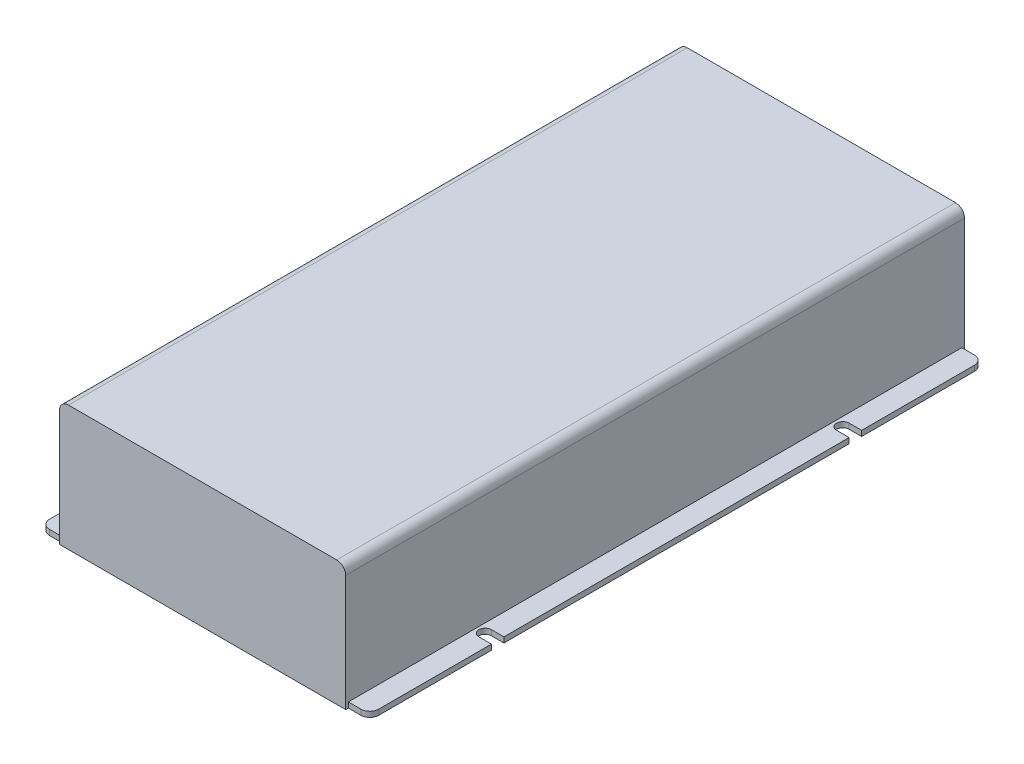
ISO-10303-21;
HEADER;
FILE_DESCRIPTION(('STEP AP214'),'2;1');
FILE_NAME('part.step','',(''),(''),'','','');
FILE_SCHEMA(('AUTOMOTIVE_DESIGN { 1 0 10303 214 1 1 1 1 }'));
ENDSEC;
DATA;
#1=APPLICATION_CONTEXT('core data for automotive mechanical design processes');
#2=APPLICATION_PROTOCOL_DEFINITION('international standard','automotive_design',2000,#1);
#3=PRODUCT_CONTEXT('',#1,'mechanical');
#4=PRODUCT('Part','Part','',(#3));
#5=PRODUCT_RELATED_PRODUCT_CATEGORY('part','',(#4));
#6=PRODUCT_DEFINITION_FORMATION('','',#4);
#7=PRODUCT_DEFINITION_CONTEXT('part definition',#1,'design');
#8=PRODUCT_DEFINITION('design','',#6,#7);
#9=PRODUCT_DEFINITION_SHAPE('','',#8);
#10=(LENGTH_UNIT() NAMED_UNIT(*) SI_UNIT(.MILLI.,.METRE.));
#11=(NAMED_UNIT(*) PLANE_ANGLE_UNIT() SI_UNIT($,.RADIAN.));
#12=(NAMED_UNIT(*) SI_UNIT($,.STERADIAN.) SOLID_ANGLE_UNIT());
#13=UNCERTAINTY_MEASURE_WITH_UNIT(LENGTH_MEASURE(1.E-05),#10,'distance_accuracy_value','');
#14=(GEOMETRIC_REPRESENTATION_CONTEXT(3) GLOBAL_UNCERTAINTY_ASSIGNED_CONTEXT((#13)) GLOBAL_UNIT_ASSIGNED_CONTEXT((#10,
#11,#12)) REPRESENTATION_CONTEXT('',''));
#15=CARTESIAN_POINT('',(0.,0.,0.));
#16=DIRECTION('',(0.,0.,1.));
#17=DIRECTION('',(1.,0.,0.));
#18=AXIS2_PLACEMENT_3D('',#15,#16,#17);
#19=CARTESIAN_POINT('',(92.,3.,171.5));
#20=DIRECTION('',(1.,0.,0.));
#21=DIRECTION('',(0.,0.,-1.));
#22=AXIS2_PLACEMENT_3D('',#19,#20,#21);
#23=PLANE('',#22);
#24=DIRECTION('',(0.,0.,1.));
#25=VECTOR('',#24,1.);
#26=CARTESIAN_POINT('',(92.,0.,171.5));
#27=LINE('',#26,#25);
#28=CARTESIAN_POINT('',(92.,0.,-166.5));
#29=VERTEX_POINT('',#28);
#30=CARTESIAN_POINT('',(92.,0.,-103.5));
#31=VERTEX_POINT('',#30);
#32=EDGE_CURVE('E541',#29,#31,#27,.T.);
#33=ORIENTED_EDGE('',*,*,#32,.F.);
#34=DIRECTION('',(0.,-1.,0.));
#35=VECTOR('',#34,1.);
#36=CARTESIAN_POINT('',(92.,3.,-166.5));
#37=LINE('',#36,#35);
#38=CARTESIAN_POINT('',(92.,3.,-166.5));
#39=VERTEX_POINT('',#38);
#40=EDGE_CURVE('E621',#29,#39,#37,.F.);
#41=ORIENTED_EDGE('',*,*,#40,.T.);
#42=DIRECTION('',(0.,0.,1.));
#43=VECTOR('',#42,1.);
#44=CARTESIAN_POINT('',(92.,3.,171.5));
#45=LINE('',#44,#43);
#46=CARTESIAN_POINT('',(92.,3.,-103.5));
#47=VERTEX_POINT('',#46);
#48=EDGE_CURVE('E529',#39,#47,#45,.T.);
#49=ORIENTED_EDGE('',*,*,#48,.T.);
#50=DIRECTION('',(0.,1.,0.));
#51=VECTOR('',#50,1.);
#52=CARTESIAN_POINT('',(92.,0.,-103.5));
#53=LINE('',#52,#51);
#54=EDGE_CURVE('E472',#31,#47,#53,.T.);
#55=ORIENTED_EDGE('',*,*,#54,.F.);
#56=EDGE_LOOP('',(#33,#41,#49,#55));
#57=FACE_BOUND('',#56,.T.);
#58=ADVANCED_FACE('F40',(#57),#23,.T.);
#59=CARTESIAN_POINT('',(92.,0.,-96.5));
#60=VERTEX_POINT('',#59);
#61=CARTESIAN_POINT('',(92.,0.,96.5));
#62=VERTEX_POINT('',#61);
#63=EDGE_CURVE('E544',#60,#62,#27,.T.);
#64=ORIENTED_EDGE('',*,*,#63,.F.);
#65=DIRECTION('',(0.,1.,0.));
#66=VECTOR('',#65,1.);
#67=CARTESIAN_POINT('',(92.,0.,-96.5));
#68=LINE('',#67,#66);
#69=CARTESIAN_POINT('',(92.,3.,-96.5));
#70=VERTEX_POINT('',#69);
#71=EDGE_CURVE('E476',#60,#70,#68,.T.);
#72=ORIENTED_EDGE('',*,*,#71,.T.);
#73=CARTESIAN_POINT('',(92.,3.,96.5));
#74=VERTEX_POINT('',#73);
#75=EDGE_CURVE('E533',#70,#74,#45,.T.);
#76=ORIENTED_EDGE('',*,*,#75,.T.);
#77=DIRECTION('',(0.,1.,0.));
#78=VECTOR('',#77,1.);
#79=CARTESIAN_POINT('',(92.,0.,96.5));
#80=LINE('',#79,#78);
#81=EDGE_CURVE('E509',#62,#74,#80,.T.);
#82=ORIENTED_EDGE('',*,*,#81,.F.);
#83=EDGE_LOOP('',(#64,#72,#76,#82));
#84=FACE_BOUND('',#83,.T.);
#85=ADVANCED_FACE('F734',(#84),#23,.T.);
#86=CARTESIAN_POINT('',(-80.,0.,173.));
#87=DIRECTION('',(0.,1.,0.));
#88=DIRECTION('',(0.,0.,1.));
#89=AXIS2_PLACEMENT_3D('',#86,#87,#88);
#90=PLANE('',#89);
#91=CARTESIAN_POINT('',(92.,0.,103.5));
#92=VERTEX_POINT('',#91);
#93=CARTESIAN_POINT('',(92.,0.,166.5));
#94=VERTEX_POINT('',#93);
#95=EDGE_CURVE('E540',#92,#94,#27,.T.);
#96=ORIENTED_EDGE('',*,*,#95,.T.);
#97=CARTESIAN_POINT('',(87.,0.,166.5));
#98=DIRECTION('',(0.,1.,0.));
#99=DIRECTION('',(0.,0.,1.));
#100=AXIS2_PLACEMENT_3D('',#97,#98,#99);
#101=CIRCLE('',#100,5.);
#102=CARTESIAN_POINT('',(87.,0.,171.5));
#103=VERTEX_POINT('',#102);
#104=EDGE_CURVE('E605',#94,#103,#101,.F.);
#105=ORIENTED_EDGE('',*,*,#104,.T.);
#106=DIRECTION('',(-1.,0.,0.));
#107=VECTOR('',#106,1.);
#108=CARTESIAN_POINT('',(80.,0.,171.5));
#109=LINE('',#108,#107);
#110=CARTESIAN_POINT('',(80.,0.,171.5));
#111=VERTEX_POINT('',#110);
#112=EDGE_CURVE('E525',#103,#111,#109,.T.);
#113=ORIENTED_EDGE('',*,*,#112,.T.);
#114=DIRECTION('',(0.,0.,-1.));
#115=VECTOR('',#114,1.);
#116=CARTESIAN_POINT('',(80.,0.,173.));
#117=LINE('',#116,#115);
#118=CARTESIAN_POINT('',(80.,0.,173.));
#119=VERTEX_POINT('',#118);
#120=EDGE_CURVE('E583',#119,#111,#117,.T.);
#121=ORIENTED_EDGE('',*,*,#120,.F.);
#122=DIRECTION('',(1.,0.,0.));
#123=VECTOR('',#122,1.);
#124=CARTESIAN_POINT('',(-80.,0.,173.));
#125=LINE('',#124,#123);
#126=CARTESIAN_POINT('',(-80.,0.,173.));
#127=VERTEX_POINT('',#126);
#128=EDGE_CURVE('E557',#127,#119,#125,.T.);
#129=ORIENTED_EDGE('',*,*,#128,.F.);
#130=DIRECTION('',(0.,0.,-1.));
#131=VECTOR('',#130,1.);
#132=CARTESIAN_POINT('',(-80.,0.,173.));
#133=LINE('',#132,#131);
#134=CARTESIAN_POINT('',(-80.,0.,171.5));
#135=VERTEX_POINT('',#134);
#136=EDGE_CURVE('E588',#127,#135,#133,.T.);
#137=ORIENTED_EDGE('',*,*,#136,.T.);
#138=DIRECTION('',(1.,0.,0.));
#139=VECTOR('',#138,1.);
#140=CARTESIAN_POINT('',(-80.,0.,171.5));
#141=LINE('',#140,#139);
#142=CARTESIAN_POINT('',(-87.,0.,171.5));
#143=VERTEX_POINT('',#142);
#144=EDGE_CURVE('E418',#143,#135,#141,.T.);
#145=ORIENTED_EDGE('',*,*,#144,.F.);
#146=CARTESIAN_POINT('',(-87.,0.,166.5));
#147=DIRECTION('',(0.,1.,0.));
#148=DIRECTION('',(0.,0.,1.));
#149=AXIS2_PLACEMENT_3D('',#146,#147,#148);
#150=CIRCLE('',#149,5.);
#151=CARTESIAN_POINT('',(-92.,0.,166.5));
#152=VERTEX_POINT('',#151);
#153=EDGE_CURVE('E599',#143,#152,#150,.F.);
#154=ORIENTED_EDGE('',*,*,#153,.T.);
#155=DIRECTION('',(0.,0.,1.));
#156=VECTOR('',#155,1.);
#157=CARTESIAN_POINT('',(-92.,0.,171.5));
#158=LINE('',#157,#156);
#159=CARTESIAN_POINT('',(-92.,0.,103.5));
#160=VERTEX_POINT('',#159);
#161=EDGE_CURVE('E432',#160,#152,#158,.T.);
#162=ORIENTED_EDGE('',*,*,#161,.F.);
#163=DIRECTION('',(-1.,0.,0.));
#164=VECTOR('',#163,1.);
#165=CARTESIAN_POINT('',(-85.,0.,103.5));
#166=LINE('',#165,#164);
#167=CARTESIAN_POINT('',(-85.,0.,103.5));
#168=VERTEX_POINT('',#167);
#169=EDGE_CURVE('E381',#168,#160,#166,.T.);
#170=ORIENTED_EDGE('',*,*,#169,.F.);
#171=CARTESIAN_POINT('',(-85.,0.,100.));
#172=DIRECTION('',(0.,-1.,0.));
#173=DIRECTION('',(0.,0.,-1.));
#174=AXIS2_PLACEMENT_3D('',#171,#172,#173);
#175=CIRCLE('',#174,3.5);
#176=CARTESIAN_POINT('',(-85.,0.,96.5));
#177=VERTEX_POINT('',#176);
#178=EDGE_CURVE('E377',#177,#168,#175,.T.);
#179=ORIENTED_EDGE('',*,*,#178,.F.);
#180=DIRECTION('',(1.,0.,0.));
#181=VECTOR('',#180,1.);
#182=CARTESIAN_POINT('',(-85.,0.,96.5));
#183=LINE('',#182,#181);
#184=CARTESIAN_POINT('',(-92.,0.,96.5));
#185=VERTEX_POINT('',#184);
#186=EDGE_CURVE('E386',#185,#177,#183,.T.);
#187=ORIENTED_EDGE('',*,*,#186,.F.);
#188=CARTESIAN_POINT('',(-92.,0.,-96.5));
#189=VERTEX_POINT('',#188);
#190=EDGE_CURVE('E354',#189,#185,#158,.T.);
#191=ORIENTED_EDGE('',*,*,#190,.F.);
#192=DIRECTION('',(1.,0.,0.));
#193=VECTOR('',#192,1.);
#194=CARTESIAN_POINT('',(-85.,0.,-96.5));
#195=LINE('',#194,#193);
#196=CARTESIAN_POINT('',(-85.,0.,-96.5));
#197=VERTEX_POINT('',#196);
#198=EDGE_CURVE('E330',#189,#197,#195,.T.);
#199=ORIENTED_EDGE('',*,*,#198,.T.);
#200=CARTESIAN_POINT('',(-85.,0.,-100.));
#201=DIRECTION('',(0.,1.,0.));
#202=DIRECTION('',(0.,0.,1.));
#203=AXIS2_PLACEMENT_3D('',#200,#201,#202);
#204=CIRCLE('',#203,3.5);
#205=CARTESIAN_POINT('',(-85.,0.,-103.5));
#206=VERTEX_POINT('',#205);
#207=EDGE_CURVE('E341',#197,#206,#204,.T.);
#208=ORIENTED_EDGE('',*,*,#207,.T.);
#209=DIRECTION('',(-1.,0.,0.));
#210=VECTOR('',#209,1.);
#211=CARTESIAN_POINT('',(-85.,0.,-103.5));
#212=LINE('',#211,#210);
#213=CARTESIAN_POINT('',(-92.,0.,-103.5));
#214=VERTEX_POINT('',#213);
#215=EDGE_CURVE('E338',#206,#214,#212,.T.);
#216=ORIENTED_EDGE('',*,*,#215,.T.);
#217=CARTESIAN_POINT('',(-92.,0.,-166.5));
#218=VERTEX_POINT('',#217);
#219=EDGE_CURVE('E433',#218,#214,#158,.T.);
#220=ORIENTED_EDGE('',*,*,#219,.F.);
#221=CARTESIAN_POINT('',(-87.,0.,-166.5));
#222=DIRECTION('',(0.,1.,0.));
#223=DIRECTION('',(0.,0.,1.));
#224=AXIS2_PLACEMENT_3D('',#221,#222,#223);
#225=CIRCLE('',#224,5.);
#226=CARTESIAN_POINT('',(-87.,0.,-171.5));
#227=VERTEX_POINT('',#226);
#228=EDGE_CURVE('E596',#218,#227,#225,.F.);
#229=ORIENTED_EDGE('',*,*,#228,.T.);
#230=DIRECTION('',(-1.,0.,0.));
#231=VECTOR('',#230,1.);
#232=CARTESIAN_POINT('',(-80.,0.,-171.5));
#233=LINE('',#232,#231);
#234=CARTESIAN_POINT('',(-80.,0.,-171.5));
#235=VERTEX_POINT('',#234);
#236=EDGE_CURVE('E404',#235,#227,#233,.T.);
#237=ORIENTED_EDGE('',*,*,#236,.F.);
#238=CARTESIAN_POINT('',(-80.,0.,-173.));
#239=VERTEX_POINT('',#238);
#240=EDGE_CURVE('E587',#235,#239,#133,.T.);
#241=ORIENTED_EDGE('',*,*,#240,.T.);
#242=DIRECTION('',(1.,0.,0.));
#243=VECTOR('',#242,1.);
#244=CARTESIAN_POINT('',(-80.,0.,-173.));
#245=LINE('',#244,#243);
#246=CARTESIAN_POINT('',(80.,0.,-173.));
#247=VERTEX_POINT('',#246);
#248=EDGE_CURVE('E572',#239,#247,#245,.T.);
#249=ORIENTED_EDGE('',*,*,#248,.T.);
#250=CARTESIAN_POINT('',(80.,0.,-171.5));
#251=VERTEX_POINT('',#250);
#252=EDGE_CURVE('E569',#251,#247,#117,.T.);
#253=ORIENTED_EDGE('',*,*,#252,.F.);
#254=DIRECTION('',(1.,0.,0.));
#255=VECTOR('',#254,1.);
#256=CARTESIAN_POINT('',(80.,0.,-171.5));
#257=LINE('',#256,#255);
#258=CARTESIAN_POINT('',(87.,0.,-171.5));
#259=VERTEX_POINT('',#258);
#260=EDGE_CURVE('E508',#251,#259,#257,.T.);
#261=ORIENTED_EDGE('',*,*,#260,.T.);
#262=CARTESIAN_POINT('',(87.,0.,-166.5));
#263=DIRECTION('',(0.,1.,0.));
#264=DIRECTION('',(0.,0.,1.));
#265=AXIS2_PLACEMENT_3D('',#262,#263,#264);
#266=CIRCLE('',#265,5.);
#267=EDGE_CURVE('E602',#259,#29,#266,.F.);
#268=ORIENTED_EDGE('',*,*,#267,.T.);
#269=ORIENTED_EDGE('',*,*,#32,.T.);
#270=DIRECTION('',(1.,0.,0.));
#271=VECTOR('',#270,1.);
#272=CARTESIAN_POINT('',(85.,0.,-103.5));
#273=LINE('',#272,#271);
#274=CARTESIAN_POINT('',(85.,0.,-103.5));
#275=VERTEX_POINT('',#274);
#276=EDGE_CURVE('E452',#275,#31,#273,.T.);
#277=ORIENTED_EDGE('',*,*,#276,.F.);
#278=CARTESIAN_POINT('',(85.,0.,-100.));
#279=DIRECTION('',(0.,-1.,0.));
#280=DIRECTION('',(0.,0.,1.));
#281=AXIS2_PLACEMENT_3D('',#278,#279,#280);
#282=CIRCLE('',#281,3.5);
#283=CARTESIAN_POINT('',(85.,0.,-96.5));
#284=VERTEX_POINT('',#283);
#285=EDGE_CURVE('E445',#284,#275,#282,.T.);
#286=ORIENTED_EDGE('',*,*,#285,.F.);
#287=DIRECTION('',(-1.,0.,0.));
#288=VECTOR('',#287,1.);
#289=CARTESIAN_POINT('',(85.,0.,-96.5));
#290=LINE('',#289,#288);
#291=EDGE_CURVE('E448',#60,#284,#290,.T.);
#292=ORIENTED_EDGE('',*,*,#291,.F.);
#293=ORIENTED_EDGE('',*,*,#63,.T.);
#294=DIRECTION('',(-1.,0.,0.));
#295=VECTOR('',#294,1.);
#296=CARTESIAN_POINT('',(85.,0.,96.5));
#297=LINE('',#296,#295);
#298=CARTESIAN_POINT('',(85.,0.,96.5));
#299=VERTEX_POINT('',#298);
#300=EDGE_CURVE('E492',#62,#299,#297,.T.);
#301=ORIENTED_EDGE('',*,*,#300,.T.);
#302=CARTESIAN_POINT('',(85.,0.,100.));
#303=DIRECTION('',(0.,1.,0.));
#304=DIRECTION('',(0.,0.,-1.));
#305=AXIS2_PLACEMENT_3D('',#302,#303,#304);
#306=CIRCLE('',#305,3.5);
#307=CARTESIAN_POINT('',(85.,0.,103.5));
#308=VERTEX_POINT('',#307);
#309=EDGE_CURVE('E483',#299,#308,#306,.T.);
#310=ORIENTED_EDGE('',*,*,#309,.T.);
#311=DIRECTION('',(1.,0.,0.));
#312=VECTOR('',#311,1.);
#313=CARTESIAN_POINT('',(85.,0.,103.5));
#314=LINE('',#313,#312);
#315=EDGE_CURVE('E487',#308,#92,#314,.T.);
#316=ORIENTED_EDGE('',*,*,#315,.T.);
#317=EDGE_LOOP('',(#96,#105,#113,#121,#129,#137,#145,#154,#162,#170,#179,#187,#191,#199,#208,
#216,#220,#229,#237,#241,#249,#253,#261,#268,#269,#277,#286,#292,#293,#301,#310,#316));
#318=FACE_BOUND('',#317,.T.);
#319=ADVANCED_FACE('F352',(#318),#90,.F.);
#320=CARTESIAN_POINT('',(0.,3.,0.));
#321=DIRECTION('',(0.,-1.,0.));
#322=DIRECTION('',(0.,0.,-1.));
#323=AXIS2_PLACEMENT_3D('',#320,#321,#322);
#324=PLANE('',#323);
#325=DIRECTION('',(-1.,0.,0.));
#326=VECTOR('',#325,1.);
#327=CARTESIAN_POINT('',(80.,3.,171.5));
#328=LINE('',#327,#326);
#329=CARTESIAN_POINT('',(87.,3.,171.5));
#330=VERTEX_POINT('',#329);
#331=CARTESIAN_POINT('',(80.,3.,171.5));
#332=VERTEX_POINT('',#331);
#333=EDGE_CURVE('E532',#330,#332,#328,.T.);
#334=ORIENTED_EDGE('',*,*,#333,.F.);
#335=CARTESIAN_POINT('',(87.,3.,166.5));
#336=DIRECTION('',(0.,-1.,0.));
#337=DIRECTION('',(0.,0.,-1.));
#338=AXIS2_PLACEMENT_3D('',#335,#336,#337);
#339=CIRCLE('',#338,5.);
#340=CARTESIAN_POINT('',(92.,3.,166.5));
#341=VERTEX_POINT('',#340);
#342=EDGE_CURVE('E614',#330,#341,#339,.F.);
#343=ORIENTED_EDGE('',*,*,#342,.T.);
#344=CARTESIAN_POINT('',(92.,3.,103.5));
#345=VERTEX_POINT('',#344);
#346=EDGE_CURVE('E528',#345,#341,#45,.T.);
#347=ORIENTED_EDGE('',*,*,#346,.F.);
#348=DIRECTION('',(1.,0.,0.));
#349=VECTOR('',#348,1.);
#350=CARTESIAN_POINT('',(85.,3.,103.5));
#351=LINE('',#350,#349);
#352=CARTESIAN_POINT('',(85.,3.,103.5));
#353=VERTEX_POINT('',#352);
#354=EDGE_CURVE('E499',#353,#345,#351,.T.);
#355=ORIENTED_EDGE('',*,*,#354,.F.);
#356=CARTESIAN_POINT('',(85.,3.,100.));
#357=DIRECTION('',(0.,1.,0.));
#358=DIRECTION('',(0.,0.,-1.));
#359=AXIS2_PLACEMENT_3D('',#356,#357,#358);
#360=CIRCLE('',#359,3.5);
#361=CARTESIAN_POINT('',(85.,3.,96.5));
#362=VERTEX_POINT('',#361);
#363=EDGE_CURVE('E471',#362,#353,#360,.T.);
#364=ORIENTED_EDGE('',*,*,#363,.F.);
#365=DIRECTION('',(-1.,0.,0.));
#366=VECTOR('',#365,1.);
#367=CARTESIAN_POINT('',(85.,3.,96.5));
#368=LINE('',#367,#366);
#369=EDGE_CURVE('E488',#74,#362,#368,.T.);
#370=ORIENTED_EDGE('',*,*,#369,.F.);
#371=ORIENTED_EDGE('',*,*,#75,.F.);
#372=DIRECTION('',(-1.,0.,0.));
#373=VECTOR('',#372,1.);
#374=CARTESIAN_POINT('',(85.,3.,-96.5));
#375=LINE('',#374,#373);
#376=CARTESIAN_POINT('',(85.,3.,-96.5));
#377=VERTEX_POINT('',#376);
#378=EDGE_CURVE('E460',#70,#377,#375,.T.);
#379=ORIENTED_EDGE('',*,*,#378,.T.);
#380=CARTESIAN_POINT('',(85.,3.,-100.));
#381=DIRECTION('',(0.,-1.,0.));
#382=DIRECTION('',(0.,0.,1.));
#383=AXIS2_PLACEMENT_3D('',#380,#381,#382);
#384=CIRCLE('',#383,3.5);
#385=CARTESIAN_POINT('',(85.,3.,-103.5));
#386=VERTEX_POINT('',#385);
#387=EDGE_CURVE('E442',#377,#386,#384,.T.);
#388=ORIENTED_EDGE('',*,*,#387,.T.);
#389=DIRECTION('',(1.,0.,0.));
#390=VECTOR('',#389,1.);
#391=CARTESIAN_POINT('',(85.,3.,-103.5));
#392=LINE('',#391,#390);
#393=EDGE_CURVE('E449',#386,#47,#392,.T.);
#394=ORIENTED_EDGE('',*,*,#393,.T.);
#395=ORIENTED_EDGE('',*,*,#48,.F.);
#396=CARTESIAN_POINT('',(87.,3.,-166.5));
#397=DIRECTION('',(0.,-1.,0.));
#398=DIRECTION('',(0.,0.,-1.));
#399=AXIS2_PLACEMENT_3D('',#396,#397,#398);
#400=CIRCLE('',#399,5.);
#401=CARTESIAN_POINT('',(87.,3.,-171.5));
#402=VERTEX_POINT('',#401);
#403=EDGE_CURVE('E611',#39,#402,#400,.F.);
#404=ORIENTED_EDGE('',*,*,#403,.T.);
#405=DIRECTION('',(1.,0.,0.));
#406=VECTOR('',#405,1.);
#407=CARTESIAN_POINT('',(80.,3.,-171.5));
#408=LINE('',#407,#406);
#409=CARTESIAN_POINT('',(80.,3.,-171.5));
#410=VERTEX_POINT('',#409);
#411=EDGE_CURVE('E524',#410,#402,#408,.T.);
#412=ORIENTED_EDGE('',*,*,#411,.F.);
#413=DIRECTION('',(0.,0.,-1.));
#414=VECTOR('',#413,1.);
#415=CARTESIAN_POINT('',(80.,3.,171.5));
#416=LINE('',#415,#414);
#417=EDGE_CURVE('E520',#332,#410,#416,.T.);
#418=ORIENTED_EDGE('',*,*,#417,.F.);
#419=EDGE_LOOP('',(#334,#343,#347,#355,#364,#370,#371,#379,#388,#394,#395,#404,#412,#418));
#420=FACE_BOUND('',#419,.T.);
#421=ADVANCED_FACE('F810',(#420),#324,.F.);
#422=CARTESIAN_POINT('',(80.,0.,173.));
#423=DIRECTION('',(-1.,0.,0.));
#424=DIRECTION('',(0.,0.,1.));
#425=AXIS2_PLACEMENT_3D('',#422,#423,#424);
#426=PLANE('',#425);
#427=DIRECTION('',(0.,1.,0.));
#428=VECTOR('',#427,1.);
#429=CARTESIAN_POINT('',(80.,0.,-173.));
#430=LINE('',#429,#428);
#431=CARTESIAN_POINT('',(80.,65.,-173.));
#432=VERTEX_POINT('',#431);
#433=EDGE_CURVE('E576',#247,#432,#430,.T.);
#434=ORIENTED_EDGE('',*,*,#433,.T.);
#435=DIRECTION('',(0.,0.,-1.));
#436=VECTOR('',#435,1.);
#437=CARTESIAN_POINT('',(80.,65.,173.));
#438=LINE('',#437,#436);
#439=CARTESIAN_POINT('',(80.,65.,173.));
#440=VERTEX_POINT('',#439);
#441=EDGE_CURVE('E637',#432,#440,#438,.F.);
#442=ORIENTED_EDGE('',*,*,#441,.T.);
#443=DIRECTION('',(0.,1.,0.));
#444=VECTOR('',#443,1.);
#445=CARTESIAN_POINT('',(80.,0.,173.));
#446=LINE('',#445,#444);
#447=EDGE_CURVE('E561',#119,#440,#446,.T.);
#448=ORIENTED_EDGE('',*,*,#447,.F.);
#449=ORIENTED_EDGE('',*,*,#120,.T.);
#450=DIRECTION('',(0.,-1.,0.));
#451=VECTOR('',#450,1.);
#452=CARTESIAN_POINT('',(80.,3.,171.5));
#453=LINE('',#452,#451);
#454=EDGE_CURVE('E547',#332,#111,#453,.T.);
#455=ORIENTED_EDGE('',*,*,#454,.F.);
#456=ORIENTED_EDGE('',*,*,#417,.T.);
#457=DIRECTION('',(0.,-1.,0.));
#458=VECTOR('',#457,1.);
#459=CARTESIAN_POINT('',(80.,3.,-171.5));
#460=LINE('',#459,#458);
#461=EDGE_CURVE('E536',#410,#251,#460,.T.);
#462=ORIENTED_EDGE('',*,*,#461,.T.);
#463=ORIENTED_EDGE('',*,*,#252,.T.);
#464=EDGE_LOOP('',(#434,#442,#448,#449,#455,#456,#462,#463));
#465=FACE_BOUND('',#464,.T.);
#466=ADVANCED_FACE('F774',(#465),#426,.F.);
#467=CARTESIAN_POINT('',(-80.,0.,173.));
#468=DIRECTION('',(1.,0.,0.));
#469=DIRECTION('',(0.,0.,-1.));
#470=AXIS2_PLACEMENT_3D('',#467,#468,#469);
#471=PLANE('',#470);
#472=DIRECTION('',(0.,-1.,0.));
#473=VECTOR('',#472,1.);
#474=CARTESIAN_POINT('',(-80.,0.,173.));
#475=LINE('',#474,#473);
#476=CARTESIAN_POINT('',(-80.,65.,173.));
#477=VERTEX_POINT('',#476);
#478=EDGE_CURVE('E554',#477,#127,#475,.T.);
#479=ORIENTED_EDGE('',*,*,#478,.F.);
#480=DIRECTION('',(0.,0.,-1.));
#481=VECTOR('',#480,1.);
#482=CARTESIAN_POINT('',(-80.,65.,173.));
#483=LINE('',#482,#481);
#484=CARTESIAN_POINT('',(-80.,65.,-173.));
#485=VERTEX_POINT('',#484);
#486=EDGE_CURVE('E646',#477,#485,#483,.T.);
#487=ORIENTED_EDGE('',*,*,#486,.T.);
#488=DIRECTION('',(0.,-1.,0.));
#489=VECTOR('',#488,1.);
#490=CARTESIAN_POINT('',(-80.,0.,-173.));
#491=LINE('',#490,#489);
#492=EDGE_CURVE('E551',#485,#239,#491,.T.);
#493=ORIENTED_EDGE('',*,*,#492,.T.);
#494=ORIENTED_EDGE('',*,*,#240,.F.);
#495=DIRECTION('',(0.,-1.,0.));
#496=VECTOR('',#495,1.);
#497=CARTESIAN_POINT('',(-80.,3.,-171.5));
#498=LINE('',#497,#496);
#499=CARTESIAN_POINT('',(-80.,3.,-171.5));
#500=VERTEX_POINT('',#499);
#501=EDGE_CURVE('E429',#500,#235,#498,.T.);
#502=ORIENTED_EDGE('',*,*,#501,.F.);
#503=DIRECTION('',(0.,0.,-1.));
#504=VECTOR('',#503,1.);
#505=CARTESIAN_POINT('',(-80.,3.,171.5));
#506=LINE('',#505,#504);
#507=CARTESIAN_POINT('',(-80.,3.,171.5));
#508=VERTEX_POINT('',#507);
#509=EDGE_CURVE('E414',#508,#500,#506,.T.);
#510=ORIENTED_EDGE('',*,*,#509,.F.);
#511=DIRECTION('',(0.,-1.,0.));
#512=VECTOR('',#511,1.);
#513=CARTESIAN_POINT('',(-80.,3.,171.5));
#514=LINE('',#513,#512);
#515=EDGE_CURVE('E438',#508,#135,#514,.T.);
#516=ORIENTED_EDGE('',*,*,#515,.T.);
#517=ORIENTED_EDGE('',*,*,#136,.F.);
#518=EDGE_LOOP('',(#479,#487,#493,#494,#502,#510,#516,#517));
#519=FACE_BOUND('',#518,.T.);
#520=ADVANCED_FACE('F702',(#519),#471,.F.);
#521=CARTESIAN_POINT('',(-80.,70.,173.));
#522=DIRECTION('',(0.,-1.,0.));
#523=DIRECTION('',(0.,0.,-1.));
#524=AXIS2_PLACEMENT_3D('',#521,#522,#523);
#525=PLANE('',#524);
#526=DIRECTION('',(-1.,0.,0.));
#527=VECTOR('',#526,1.);
#528=CARTESIAN_POINT('',(-80.,70.,173.));
#529=LINE('',#528,#527);
#530=CARTESIAN_POINT('',(75.,70.,173.));
#531=VERTEX_POINT('',#530);
#532=CARTESIAN_POINT('',(-75.,70.,173.));
#533=VERTEX_POINT('',#532);
#534=EDGE_CURVE('E565',#531,#533,#529,.T.);
#535=ORIENTED_EDGE('',*,*,#534,.F.);
#536=DIRECTION('',(0.,0.,-1.));
#537=VECTOR('',#536,1.);
#538=CARTESIAN_POINT('',(75.,70.,173.));
#539=LINE('',#538,#537);
#540=CARTESIAN_POINT('',(75.,70.,-173.));
#541=VERTEX_POINT('',#540);
#542=EDGE_CURVE('E627',#531,#541,#539,.T.);
#543=ORIENTED_EDGE('',*,*,#542,.T.);
#544=DIRECTION('',(-1.,0.,0.));
#545=VECTOR('',#544,1.);
#546=CARTESIAN_POINT('',(-80.,70.,-173.));
#547=LINE('',#546,#545);
#548=CARTESIAN_POINT('',(-75.,70.,-173.));
#549=VERTEX_POINT('',#548);
#550=EDGE_CURVE('E558',#541,#549,#547,.T.);
#551=ORIENTED_EDGE('',*,*,#550,.T.);
#552=DIRECTION('',(0.,0.,-1.));
#553=VECTOR('',#552,1.);
#554=CARTESIAN_POINT('',(-75.,70.,173.));
#555=LINE('',#554,#553);
#556=EDGE_CURVE('E624',#549,#533,#555,.F.);
#557=ORIENTED_EDGE('',*,*,#556,.T.);
#558=EDGE_LOOP('',(#535,#543,#551,#557));
#559=FACE_BOUND('',#558,.T.);
#560=ADVANCED_FACE('F785',(#559),#525,.F.);
#561=CARTESIAN_POINT('',(0.,0.,173.));
#562=DIRECTION('',(0.,0.,-1.));
#563=DIRECTION('',(-1.,0.,0.));
#564=AXIS2_PLACEMENT_3D('',#561,#562,#563);
#565=PLANE('',#564);
#566=ORIENTED_EDGE('',*,*,#447,.T.);
#567=CARTESIAN_POINT('',(75.,65.,173.));
#568=DIRECTION('',(0.,0.,-1.));
#569=DIRECTION('',(-1.,0.,0.));
#570=AXIS2_PLACEMENT_3D('',#567,#568,#569);
#571=CIRCLE('',#570,5.);
#572=EDGE_CURVE('E643',#440,#531,#571,.F.);
#573=ORIENTED_EDGE('',*,*,#572,.T.);
#574=ORIENTED_EDGE('',*,*,#534,.T.);
#575=CARTESIAN_POINT('',(-75.,65.,173.));
#576=DIRECTION('',(0.,0.,-1.));
#577=DIRECTION('',(-1.,0.,0.));
#578=AXIS2_PLACEMENT_3D('',#575,#576,#577);
#579=CIRCLE('',#578,5.);
#580=EDGE_CURVE('E640',#533,#477,#579,.F.);
#581=ORIENTED_EDGE('',*,*,#580,.T.);
#582=ORIENTED_EDGE('',*,*,#478,.T.);
#583=ORIENTED_EDGE('',*,*,#128,.T.);
#584=EDGE_LOOP('',(#566,#573,#574,#581,#582,#583));
#585=FACE_BOUND('',#584,.T.);
#586=ADVANCED_FACE('F778',(#585),#565,.F.);
#587=CARTESIAN_POINT('',(0.,0.,-173.));
#588=DIRECTION('',(0.,0.,-1.));
#589=DIRECTION('',(-1.,0.,0.));
#590=AXIS2_PLACEMENT_3D('',#587,#588,#589);
#591=PLANE('',#590);
#592=ORIENTED_EDGE('',*,*,#550,.F.);
#593=CARTESIAN_POINT('',(75.,65.,-173.));
#594=DIRECTION('',(0.,0.,-1.));
#595=DIRECTION('',(-1.,0.,0.));
#596=AXIS2_PLACEMENT_3D('',#593,#594,#595);
#597=CIRCLE('',#596,5.);
#598=EDGE_CURVE('E634',#541,#432,#597,.T.);
#599=ORIENTED_EDGE('',*,*,#598,.T.);
#600=ORIENTED_EDGE('',*,*,#433,.F.);
#601=ORIENTED_EDGE('',*,*,#248,.F.);
#602=ORIENTED_EDGE('',*,*,#492,.F.);
#603=CARTESIAN_POINT('',(-75.,65.,-173.));
#604=DIRECTION('',(0.,0.,-1.));
#605=DIRECTION('',(-1.,0.,0.));
#606=AXIS2_PLACEMENT_3D('',#603,#604,#605);
#607=CIRCLE('',#606,5.);
#608=EDGE_CURVE('E631',#485,#549,#607,.T.);
#609=ORIENTED_EDGE('',*,*,#608,.T.);
#610=EDGE_LOOP('',(#592,#599,#600,#601,#602,#609));
#611=FACE_BOUND('',#610,.T.);
#612=ADVANCED_FACE('F755',(#611),#591,.T.);
#613=CARTESIAN_POINT('',(80.,3.,171.5));
#614=DIRECTION('',(0.,0.,1.));
#615=DIRECTION('',(1.,0.,0.));
#616=AXIS2_PLACEMENT_3D('',#613,#614,#615);
#617=PLANE('',#616);
#618=ORIENTED_EDGE('',*,*,#112,.F.);
#619=DIRECTION('',(0.,-1.,0.));
#620=VECTOR('',#619,1.);
#621=CARTESIAN_POINT('',(87.,3.,171.5));
#622=LINE('',#621,#620);
#623=EDGE_CURVE('E608',#103,#330,#622,.F.);
#624=ORIENTED_EDGE('',*,*,#623,.T.);
#625=ORIENTED_EDGE('',*,*,#333,.T.);
#626=ORIENTED_EDGE('',*,*,#454,.T.);
#627=EDGE_LOOP('',(#618,#624,#625,#626));
#628=FACE_BOUND('',#627,.T.);
#629=ADVANCED_FACE('F747',(#628),#617,.T.);
#630=ORIENTED_EDGE('',*,*,#346,.T.);
#631=DIRECTION('',(0.,-1.,0.));
#632=VECTOR('',#631,1.);
#633=CARTESIAN_POINT('',(92.,3.,166.5));
#634=LINE('',#633,#632);
#635=EDGE_CURVE('E592',#341,#94,#634,.T.);
#636=ORIENTED_EDGE('',*,*,#635,.T.);
#637=ORIENTED_EDGE('',*,*,#95,.F.);
#638=DIRECTION('',(0.,1.,0.));
#639=VECTOR('',#638,1.);
#640=CARTESIAN_POINT('',(92.,0.,103.5));
#641=LINE('',#640,#639);
#642=EDGE_CURVE('E513',#92,#345,#641,.T.);
#643=ORIENTED_EDGE('',*,*,#642,.T.);
#644=EDGE_LOOP('',(#630,#636,#637,#643));
#645=FACE_BOUND('',#644,.T.);
#646=ADVANCED_FACE('F737',(#645),#23,.T.);
#647=CARTESIAN_POINT('',(80.,3.,-171.5));
#648=DIRECTION('',(0.,0.,-1.));
#649=DIRECTION('',(-1.,0.,0.));
#650=AXIS2_PLACEMENT_3D('',#647,#648,#649);
#651=PLANE('',#650);
#652=ORIENTED_EDGE('',*,*,#411,.T.);
#653=DIRECTION('',(0.,-1.,0.));
#654=VECTOR('',#653,1.);
#655=CARTESIAN_POINT('',(87.,3.,-171.5));
#656=LINE('',#655,#654);
#657=EDGE_CURVE('E617',#402,#259,#656,.T.);
#658=ORIENTED_EDGE('',*,*,#657,.T.);
#659=ORIENTED_EDGE('',*,*,#260,.F.);
#660=ORIENTED_EDGE('',*,*,#461,.F.);
#661=EDGE_LOOP('',(#652,#658,#659,#660));
#662=FACE_BOUND('',#661,.T.);
#663=ADVANCED_FACE('F746',(#662),#651,.T.);
#664=CARTESIAN_POINT('',(85.,0.,100.));
#665=DIRECTION('',(0.,1.,0.));
#666=DIRECTION('',(0.,0.,1.));
#667=AXIS2_PLACEMENT_3D('',#664,#665,#666);
#668=CYLINDRICAL_SURFACE('',#667,3.5);
#669=ORIENTED_EDGE('',*,*,#363,.T.);
#670=DIRECTION('',(0.,1.,0.));
#671=VECTOR('',#670,1.);
#672=CARTESIAN_POINT('',(85.,0.,103.5));
#673=LINE('',#672,#671);
#674=EDGE_CURVE('E496',#308,#353,#673,.T.);
#675=ORIENTED_EDGE('',*,*,#674,.F.);
#676=ORIENTED_EDGE('',*,*,#309,.F.);
#677=DIRECTION('',(0.,1.,0.));
#678=VECTOR('',#677,1.);
#679=CARTESIAN_POINT('',(85.,0.,96.5));
#680=LINE('',#679,#678);
#681=EDGE_CURVE('E505',#299,#362,#680,.T.);
#682=ORIENTED_EDGE('',*,*,#681,.T.);
#683=EDGE_LOOP('',(#669,#675,#676,#682));
#684=FACE_BOUND('',#683,.T.);
#685=ADVANCED_FACE('F753',(#684),#668,.F.);
#686=CARTESIAN_POINT('',(85.,0.,96.5));
#687=DIRECTION('',(0.,0.,-1.));
#688=DIRECTION('',(-1.,0.,0.));
#689=AXIS2_PLACEMENT_3D('',#686,#687,#688);
#690=PLANE('',#689);
#691=ORIENTED_EDGE('',*,*,#369,.T.);
#692=ORIENTED_EDGE('',*,*,#681,.F.);
#693=ORIENTED_EDGE('',*,*,#300,.F.);
#694=ORIENTED_EDGE('',*,*,#81,.T.);
#695=EDGE_LOOP('',(#691,#692,#693,#694));
#696=FACE_BOUND('',#695,.T.);
#697=ADVANCED_FACE('F1008',(#696),#690,.F.);
#698=CARTESIAN_POINT('',(85.,0.,103.5));
#699=DIRECTION('',(0.,0.,1.));
#700=DIRECTION('',(1.,0.,0.));
#701=AXIS2_PLACEMENT_3D('',#698,#699,#700);
#702=PLANE('',#701);
#703=ORIENTED_EDGE('',*,*,#354,.T.);
#704=ORIENTED_EDGE('',*,*,#642,.F.);
#705=ORIENTED_EDGE('',*,*,#315,.F.);
#706=ORIENTED_EDGE('',*,*,#674,.T.);
#707=EDGE_LOOP('',(#703,#704,#705,#706));
#708=FACE_BOUND('',#707,.T.);
#709=ADVANCED_FACE('F1006',(#708),#702,.F.);
#710=CARTESIAN_POINT('',(85.,0.,-100.));
#711=DIRECTION('',(0.,1.,0.));
#712=DIRECTION('',(0.,0.,1.));
#713=AXIS2_PLACEMENT_3D('',#710,#711,#712);
#714=CYLINDRICAL_SURFACE('',#713,3.5);
#715=ORIENTED_EDGE('',*,*,#387,.F.);
#716=DIRECTION('',(0.,1.,0.));
#717=VECTOR('',#716,1.);
#718=CARTESIAN_POINT('',(85.,0.,-96.5));
#719=LINE('',#718,#717);
#720=EDGE_CURVE('E456',#284,#377,#719,.T.);
#721=ORIENTED_EDGE('',*,*,#720,.F.);
#722=ORIENTED_EDGE('',*,*,#285,.T.);
#723=DIRECTION('',(0.,1.,0.));
#724=VECTOR('',#723,1.);
#725=CARTESIAN_POINT('',(85.,0.,-103.5));
#726=LINE('',#725,#724);
#727=EDGE_CURVE('E467',#275,#386,#726,.T.);
#728=ORIENTED_EDGE('',*,*,#727,.T.);
#729=EDGE_LOOP('',(#715,#721,#722,#728));
#730=FACE_BOUND('',#729,.T.);
#731=ADVANCED_FACE('F991',(#730),#714,.F.);
#732=CARTESIAN_POINT('',(85.,0.,-103.5));
#733=DIRECTION('',(0.,0.,1.));
#734=DIRECTION('',(1.,0.,0.));
#735=AXIS2_PLACEMENT_3D('',#732,#733,#734);
#736=PLANE('',#735);
#737=ORIENTED_EDGE('',*,*,#393,.F.);
#738=ORIENTED_EDGE('',*,*,#727,.F.);
#739=ORIENTED_EDGE('',*,*,#276,.T.);
#740=ORIENTED_EDGE('',*,*,#54,.T.);
#741=EDGE_LOOP('',(#737,#738,#739,#740));
#742=FACE_BOUND('',#741,.T.);
#743=ADVANCED_FACE('F986',(#742),#736,.T.);
#744=CARTESIAN_POINT('',(85.,0.,-96.5));
#745=DIRECTION('',(0.,0.,-1.));
#746=DIRECTION('',(-1.,0.,0.));
#747=AXIS2_PLACEMENT_3D('',#744,#745,#746);
#748=PLANE('',#747);
#749=ORIENTED_EDGE('',*,*,#378,.F.);
#750=ORIENTED_EDGE('',*,*,#71,.F.);
#751=ORIENTED_EDGE('',*,*,#291,.T.);
#752=ORIENTED_EDGE('',*,*,#720,.T.);
#753=EDGE_LOOP('',(#749,#750,#751,#752));
#754=FACE_BOUND('',#753,.T.);
#755=ADVANCED_FACE('F854',(#754),#748,.T.);
#756=CARTESIAN_POINT('',(-92.,3.,171.5));
#757=DIRECTION('',(-1.,0.,0.));
#758=DIRECTION('',(0.,0.,-1.));
#759=AXIS2_PLACEMENT_3D('',#756,#757,#758);
#760=PLANE('',#759);
#761=DIRECTION('',(0.,0.,1.));
#762=VECTOR('',#761,1.);
#763=CARTESIAN_POINT('',(-92.,3.,171.5));
#764=LINE('',#763,#762);
#765=CARTESIAN_POINT('',(-92.,3.,-166.5));
#766=VERTEX_POINT('',#765);
#767=CARTESIAN_POINT('',(-92.,3.,-103.5));
#768=VERTEX_POINT('',#767);
#769=EDGE_CURVE('E422',#766,#768,#764,.T.);
#770=ORIENTED_EDGE('',*,*,#769,.F.);
#771=DIRECTION('',(0.,-1.,0.));
#772=VECTOR('',#771,1.);
#773=CARTESIAN_POINT('',(-92.,3.,-166.5));
#774=LINE('',#773,#772);
#775=EDGE_CURVE('E49',#766,#218,#774,.T.);
#776=ORIENTED_EDGE('',*,*,#775,.T.);
#777=ORIENTED_EDGE('',*,*,#219,.T.);
#778=DIRECTION('',(0.,1.,0.));
#779=VECTOR('',#778,1.);
#780=CARTESIAN_POINT('',(-92.,0.,-103.5));
#781=LINE('',#780,#779);
#782=EDGE_CURVE('E371',#214,#768,#781,.T.);
#783=ORIENTED_EDGE('',*,*,#782,.T.);
#784=EDGE_LOOP('',(#770,#776,#777,#783));
#785=FACE_BOUND('',#784,.T.);
#786=ADVANCED_FACE('F666',(#785),#760,.T.);
#787=ORIENTED_EDGE('',*,*,#190,.T.);
#788=DIRECTION('',(0.,1.,0.));
#789=VECTOR('',#788,1.);
#790=CARTESIAN_POINT('',(-92.,0.,96.5));
#791=LINE('',#790,#789);
#792=CARTESIAN_POINT('',(-92.,3.,96.5));
#793=VERTEX_POINT('',#792);
#794=EDGE_CURVE('E405',#185,#793,#791,.T.);
#795=ORIENTED_EDGE('',*,*,#794,.T.);
#796=CARTESIAN_POINT('',(-92.,3.,-96.5));
#797=VERTEX_POINT('',#796);
#798=EDGE_CURVE('E426',#797,#793,#764,.T.);
#799=ORIENTED_EDGE('',*,*,#798,.F.);
#800=DIRECTION('',(0.,1.,0.));
#801=VECTOR('',#800,1.);
#802=CARTESIAN_POINT('',(-92.,0.,-96.5));
#803=LINE('',#802,#801);
#804=EDGE_CURVE('E337',#189,#797,#803,.T.);
#805=ORIENTED_EDGE('',*,*,#804,.F.);
#806=EDGE_LOOP('',(#787,#795,#799,#805));
#807=FACE_BOUND('',#806,.T.);
#808=ADVANCED_FACE('F678',(#807),#760,.T.);
#809=CARTESIAN_POINT('',(0.,3.,0.));
#810=DIRECTION('',(0.,-1.,0.));
#811=DIRECTION('',(0.,0.,-1.));
#812=AXIS2_PLACEMENT_3D('',#809,#810,#811);
#813=PLANE('',#812);
#814=CARTESIAN_POINT('',(-92.,3.,103.5));
#815=VERTEX_POINT('',#814);
#816=CARTESIAN_POINT('',(-92.,3.,166.5));
#817=VERTEX_POINT('',#816);
#818=EDGE_CURVE('E421',#815,#817,#764,.T.);
#819=ORIENTED_EDGE('',*,*,#818,.T.);
#820=CARTESIAN_POINT('',(-87.,3.,166.5));
#821=DIRECTION('',(0.,-1.,0.));
#822=DIRECTION('',(0.,0.,-1.));
#823=AXIS2_PLACEMENT_3D('',#820,#821,#822);
#824=CIRCLE('',#823,5.);
#825=CARTESIAN_POINT('',(-87.,3.,171.5));
#826=VERTEX_POINT('',#825);
#827=EDGE_CURVE('E659',#817,#826,#824,.F.);
#828=ORIENTED_EDGE('',*,*,#827,.T.);
#829=DIRECTION('',(1.,0.,0.));
#830=VECTOR('',#829,1.);
#831=CARTESIAN_POINT('',(-80.,3.,171.5));
#832=LINE('',#831,#830);
#833=EDGE_CURVE('E425',#826,#508,#832,.T.);
#834=ORIENTED_EDGE('',*,*,#833,.T.);
#835=ORIENTED_EDGE('',*,*,#509,.T.);
#836=DIRECTION('',(-1.,0.,0.));
#837=VECTOR('',#836,1.);
#838=CARTESIAN_POINT('',(-80.,3.,-171.5));
#839=LINE('',#838,#837);
#840=CARTESIAN_POINT('',(-87.,3.,-171.5));
#841=VERTEX_POINT('',#840);
#842=EDGE_CURVE('E417',#500,#841,#839,.T.);
#843=ORIENTED_EDGE('',*,*,#842,.T.);
#844=CARTESIAN_POINT('',(-87.,3.,-166.5));
#845=DIRECTION('',(0.,-1.,0.));
#846=DIRECTION('',(0.,0.,-1.));
#847=AXIS2_PLACEMENT_3D('',#844,#845,#846);
#848=CIRCLE('',#847,5.);
#849=EDGE_CURVE('E59',#841,#766,#848,.F.);
#850=ORIENTED_EDGE('',*,*,#849,.T.);
#851=ORIENTED_EDGE('',*,*,#769,.T.);
#852=DIRECTION('',(-1.,0.,0.));
#853=VECTOR('',#852,1.);
#854=CARTESIAN_POINT('',(-85.,3.,-103.5));
#855=LINE('',#854,#853);
#856=CARTESIAN_POINT('',(-85.,3.,-103.5));
#857=VERTEX_POINT('',#856);
#858=EDGE_CURVE('E348',#857,#768,#855,.T.);
#859=ORIENTED_EDGE('',*,*,#858,.F.);
#860=CARTESIAN_POINT('',(-85.,3.,-100.));
#861=DIRECTION('',(0.,1.,0.));
#862=DIRECTION('',(0.,0.,1.));
#863=AXIS2_PLACEMENT_3D('',#860,#861,#862);
#864=CIRCLE('',#863,3.5);
#865=CARTESIAN_POINT('',(-85.,3.,-96.5));
#866=VERTEX_POINT('',#865);
#867=EDGE_CURVE('E362',#866,#857,#864,.T.);
#868=ORIENTED_EDGE('',*,*,#867,.F.);
#869=DIRECTION('',(1.,0.,0.));
#870=VECTOR('',#869,1.);
#871=CARTESIAN_POINT('',(-85.,3.,-96.5));
#872=LINE('',#871,#870);
#873=EDGE_CURVE('E332',#797,#866,#872,.T.);
#874=ORIENTED_EDGE('',*,*,#873,.F.);
#875=ORIENTED_EDGE('',*,*,#798,.T.);
#876=DIRECTION('',(1.,0.,0.));
#877=VECTOR('',#876,1.);
#878=CARTESIAN_POINT('',(-85.,3.,96.5));
#879=LINE('',#878,#877);
#880=CARTESIAN_POINT('',(-85.,3.,96.5));
#881=VERTEX_POINT('',#880);
#882=EDGE_CURVE('E382',#793,#881,#879,.T.);
#883=ORIENTED_EDGE('',*,*,#882,.T.);
#884=CARTESIAN_POINT('',(-85.,3.,100.));
#885=DIRECTION('',(0.,-1.,0.));
#886=DIRECTION('',(0.,0.,-1.));
#887=AXIS2_PLACEMENT_3D('',#884,#885,#886);
#888=CIRCLE('',#887,3.5);
#889=CARTESIAN_POINT('',(-85.,3.,103.5));
#890=VERTEX_POINT('',#889);
#891=EDGE_CURVE('E370',#881,#890,#888,.T.);
#892=ORIENTED_EDGE('',*,*,#891,.T.);
#893=DIRECTION('',(-1.,0.,0.));
#894=VECTOR('',#893,1.);
#895=CARTESIAN_POINT('',(-85.,3.,103.5));
#896=LINE('',#895,#894);
#897=EDGE_CURVE('E394',#890,#815,#896,.T.);
#898=ORIENTED_EDGE('',*,*,#897,.T.);
#899=EDGE_LOOP('',(#819,#828,#834,#835,#843,#850,#851,#859,#868,#874,#875,#883,#892,#898));
#900=FACE_BOUND('',#899,.T.);
#901=ADVANCED_FACE('F674',(#900),#813,.F.);
#902=CARTESIAN_POINT('',(-80.,3.,171.5));
#903=DIRECTION('',(0.,0.,1.));
#904=DIRECTION('',(-1.,0.,0.));
#905=AXIS2_PLACEMENT_3D('',#902,#903,#904);
#906=PLANE('',#905);
#907=ORIENTED_EDGE('',*,*,#833,.F.);
#908=DIRECTION('',(0.,-1.,0.));
#909=VECTOR('',#908,1.);
#910=CARTESIAN_POINT('',(-87.,3.,171.5));
#911=LINE('',#910,#909);
#912=EDGE_CURVE('E650',#826,#143,#911,.T.);
#913=ORIENTED_EDGE('',*,*,#912,.T.);
#914=ORIENTED_EDGE('',*,*,#144,.T.);
#915=ORIENTED_EDGE('',*,*,#515,.F.);
#916=EDGE_LOOP('',(#907,#913,#914,#915));
#917=FACE_BOUND('',#916,.T.);
#918=ADVANCED_FACE('F693',(#917),#906,.T.);
#919=ORIENTED_EDGE('',*,*,#161,.T.);
#920=DIRECTION('',(0.,-1.,0.));
#921=VECTOR('',#920,1.);
#922=CARTESIAN_POINT('',(-92.,3.,166.5));
#923=LINE('',#922,#921);
#924=EDGE_CURVE('E654',#152,#817,#923,.F.);
#925=ORIENTED_EDGE('',*,*,#924,.T.);
#926=ORIENTED_EDGE('',*,*,#818,.F.);
#927=DIRECTION('',(0.,1.,0.));
#928=VECTOR('',#927,1.);
#929=CARTESIAN_POINT('',(-92.,0.,103.5));
#930=LINE('',#929,#928);
#931=EDGE_CURVE('E409',#160,#815,#930,.T.);
#932=ORIENTED_EDGE('',*,*,#931,.F.);
#933=EDGE_LOOP('',(#919,#925,#926,#932));
#934=FACE_BOUND('',#933,.T.);
#935=ADVANCED_FACE('F714',(#934),#760,.T.);
#936=CARTESIAN_POINT('',(-80.,3.,-171.5));
#937=DIRECTION('',(0.,0.,-1.));
#938=DIRECTION('',(1.,0.,0.));
#939=AXIS2_PLACEMENT_3D('',#936,#937,#938);
#940=PLANE('',#939);
#941=ORIENTED_EDGE('',*,*,#236,.T.);
#942=DIRECTION('',(0.,-1.,0.));
#943=VECTOR('',#942,1.);
#944=CARTESIAN_POINT('',(-87.,3.,-171.5));
#945=LINE('',#944,#943);
#946=EDGE_CURVE('E11',#227,#841,#945,.F.);
#947=ORIENTED_EDGE('',*,*,#946,.T.);
#948=ORIENTED_EDGE('',*,*,#842,.F.);
#949=ORIENTED_EDGE('',*,*,#501,.T.);
#950=EDGE_LOOP('',(#941,#947,#948,#949));
#951=FACE_BOUND('',#950,.T.);
#952=ADVANCED_FACE('F707',(#951),#940,.T.);
#953=CARTESIAN_POINT('',(-85.,0.,100.));
#954=DIRECTION('',(0.,1.,0.));
#955=DIRECTION('',(0.,0.,1.));
#956=AXIS2_PLACEMENT_3D('',#953,#954,#955);
#957=CYLINDRICAL_SURFACE('',#956,3.5);
#958=ORIENTED_EDGE('',*,*,#891,.F.);
#959=DIRECTION('',(0.,1.,0.));
#960=VECTOR('',#959,1.);
#961=CARTESIAN_POINT('',(-85.,0.,96.5));
#962=LINE('',#961,#960);
#963=EDGE_CURVE('E401',#177,#881,#962,.T.);
#964=ORIENTED_EDGE('',*,*,#963,.F.);
#965=ORIENTED_EDGE('',*,*,#178,.T.);
#966=DIRECTION('',(0.,1.,0.));
#967=VECTOR('',#966,1.);
#968=CARTESIAN_POINT('',(-85.,0.,103.5));
#969=LINE('',#968,#967);
#970=EDGE_CURVE('E390',#168,#890,#969,.T.);
#971=ORIENTED_EDGE('',*,*,#970,.T.);
#972=EDGE_LOOP('',(#958,#964,#965,#971));
#973=FACE_BOUND('',#972,.T.);
#974=ADVANCED_FACE('F721',(#973),#957,.F.);
#975=CARTESIAN_POINT('',(-85.,0.,96.5));
#976=DIRECTION('',(0.,0.,-1.));
#977=DIRECTION('',(1.,0.,0.));
#978=AXIS2_PLACEMENT_3D('',#975,#976,#977);
#979=PLANE('',#978);
#980=ORIENTED_EDGE('',*,*,#882,.F.);
#981=ORIENTED_EDGE('',*,*,#794,.F.);
#982=ORIENTED_EDGE('',*,*,#186,.T.);
#983=ORIENTED_EDGE('',*,*,#963,.T.);
#984=EDGE_LOOP('',(#980,#981,#982,#983));
#985=FACE_BOUND('',#984,.T.);
#986=ADVANCED_FACE('F723',(#985),#979,.F.);
#987=CARTESIAN_POINT('',(-85.,0.,103.5));
#988=DIRECTION('',(0.,0.,1.));
#989=DIRECTION('',(-1.,0.,0.));
#990=AXIS2_PLACEMENT_3D('',#987,#988,#989);
#991=PLANE('',#990);
#992=ORIENTED_EDGE('',*,*,#897,.F.);
#993=ORIENTED_EDGE('',*,*,#970,.F.);
#994=ORIENTED_EDGE('',*,*,#169,.T.);
#995=ORIENTED_EDGE('',*,*,#931,.T.);
#996=EDGE_LOOP('',(#992,#993,#994,#995));
#997=FACE_BOUND('',#996,.T.);
#998=ADVANCED_FACE('F718',(#997),#991,.F.);
#999=CARTESIAN_POINT('',(-85.,0.,-100.));
#1000=DIRECTION('',(0.,1.,0.));
#1001=DIRECTION('',(0.,0.,1.));
#1002=AXIS2_PLACEMENT_3D('',#999,#1000,#1001);
#1003=CYLINDRICAL_SURFACE('',#1002,3.5);
#1004=ORIENTED_EDGE('',*,*,#867,.T.);
#1005=DIRECTION('',(0.,1.,0.));
#1006=VECTOR('',#1005,1.);
#1007=CARTESIAN_POINT('',(-85.,0.,-103.5));
#1008=LINE('',#1007,#1006);
#1009=EDGE_CURVE('E343',#206,#857,#1008,.T.);
#1010=ORIENTED_EDGE('',*,*,#1009,.F.);
#1011=ORIENTED_EDGE('',*,*,#207,.F.);
#1012=DIRECTION('',(0.,1.,0.));
#1013=VECTOR('',#1012,1.);
#1014=CARTESIAN_POINT('',(-85.,0.,-96.5));
#1015=LINE('',#1014,#1013);
#1016=EDGE_CURVE('E325',#197,#866,#1015,.T.);
#1017=ORIENTED_EDGE('',*,*,#1016,.T.);
#1018=EDGE_LOOP('',(#1004,#1010,#1011,#1017));
#1019=FACE_BOUND('',#1018,.T.);
#1020=ADVANCED_FACE('F342',(#1019),#1003,.F.);
#1021=CARTESIAN_POINT('',(-85.,0.,-103.5));
#1022=DIRECTION('',(0.,0.,1.));
#1023=DIRECTION('',(-1.,0.,0.));
#1024=AXIS2_PLACEMENT_3D('',#1021,#1022,#1023);
#1025=PLANE('',#1024);
#1026=ORIENTED_EDGE('',*,*,#858,.T.);
#1027=ORIENTED_EDGE('',*,*,#782,.F.);
#1028=ORIENTED_EDGE('',*,*,#215,.F.);
#1029=ORIENTED_EDGE('',*,*,#1009,.T.);
#1030=EDGE_LOOP('',(#1026,#1027,#1028,#1029));
#1031=FACE_BOUND('',#1030,.T.);
#1032=ADVANCED_FACE('F671',(#1031),#1025,.T.);
#1033=CARTESIAN_POINT('',(-85.,0.,-96.5));
#1034=DIRECTION('',(0.,0.,-1.));
#1035=DIRECTION('',(1.,0.,0.));
#1036=AXIS2_PLACEMENT_3D('',#1033,#1034,#1035);
#1037=PLANE('',#1036);
#1038=ORIENTED_EDGE('',*,*,#873,.T.);
#1039=ORIENTED_EDGE('',*,*,#1016,.F.);
#1040=ORIENTED_EDGE('',*,*,#198,.F.);
#1041=ORIENTED_EDGE('',*,*,#804,.T.);
#1042=EDGE_LOOP('',(#1038,#1039,#1040,#1041));
#1043=FACE_BOUND('',#1042,.T.);
#1044=ADVANCED_FACE('F327',(#1043),#1037,.T.);
#1045=CARTESIAN_POINT('',(87.,3.,166.5));
#1046=DIRECTION('',(0.,-1.,0.));
#1047=DIRECTION('',(0.,0.,-1.));
#1048=AXIS2_PLACEMENT_3D('',#1045,#1046,#1047);
#1049=CYLINDRICAL_SURFACE('',#1048,5.);
#1050=ORIENTED_EDGE('',*,*,#342,.F.);
#1051=ORIENTED_EDGE('',*,*,#623,.F.);
#1052=ORIENTED_EDGE('',*,*,#104,.F.);
#1053=ORIENTED_EDGE('',*,*,#635,.F.);
#1054=EDGE_LOOP('',(#1050,#1051,#1052,#1053));
#1055=FACE_BOUND('',#1054,.T.);
#1056=ADVANCED_FACE('F766',(#1055),#1049,.T.);
#1057=CARTESIAN_POINT('',(87.,3.,-166.5));
#1058=DIRECTION('',(0.,-1.,0.));
#1059=DIRECTION('',(0.,0.,-1.));
#1060=AXIS2_PLACEMENT_3D('',#1057,#1058,#1059);
#1061=CYLINDRICAL_SURFACE('',#1060,5.);
#1062=ORIENTED_EDGE('',*,*,#403,.F.);
#1063=ORIENTED_EDGE('',*,*,#40,.F.);
#1064=ORIENTED_EDGE('',*,*,#267,.F.);
#1065=ORIENTED_EDGE('',*,*,#657,.F.);
#1066=EDGE_LOOP('',(#1062,#1063,#1064,#1065));
#1067=FACE_BOUND('',#1066,.T.);
#1068=ADVANCED_FACE('F798',(#1067),#1061,.T.);
#1069=CARTESIAN_POINT('',(75.,65.,173.));
#1070=DIRECTION('',(0.,0.,-1.));
#1071=DIRECTION('',(-1.,0.,0.));
#1072=AXIS2_PLACEMENT_3D('',#1069,#1070,#1071);
#1073=CYLINDRICAL_SURFACE('',#1072,5.);
#1074=ORIENTED_EDGE('',*,*,#572,.F.);
#1075=ORIENTED_EDGE('',*,*,#441,.F.);
#1076=ORIENTED_EDGE('',*,*,#598,.F.);
#1077=ORIENTED_EDGE('',*,*,#542,.F.);
#1078=EDGE_LOOP('',(#1074,#1075,#1076,#1077));
#1079=FACE_BOUND('',#1078,.T.);
#1080=ADVANCED_FACE('F782',(#1079),#1073,.T.);
#1081=CARTESIAN_POINT('',(-75.,65.,173.));
#1082=DIRECTION('',(0.,0.,-1.));
#1083=DIRECTION('',(-1.,0.,0.));
#1084=AXIS2_PLACEMENT_3D('',#1081,#1082,#1083);
#1085=CYLINDRICAL_SURFACE('',#1084,5.);
#1086=ORIENTED_EDGE('',*,*,#580,.F.);
#1087=ORIENTED_EDGE('',*,*,#556,.F.);
#1088=ORIENTED_EDGE('',*,*,#608,.F.);
#1089=ORIENTED_EDGE('',*,*,#486,.F.);
#1090=EDGE_LOOP('',(#1086,#1087,#1088,#1089));
#1091=FACE_BOUND('',#1090,.T.);
#1092=ADVANCED_FACE('F791',(#1091),#1085,.T.);
#1093=CARTESIAN_POINT('',(-87.,3.,166.5));
#1094=DIRECTION('',(0.,-1.,0.));
#1095=DIRECTION('',(0.,0.,-1.));
#1096=AXIS2_PLACEMENT_3D('',#1093,#1094,#1095);
#1097=CYLINDRICAL_SURFACE('',#1096,5.);
#1098=ORIENTED_EDGE('',*,*,#827,.F.);
#1099=ORIENTED_EDGE('',*,*,#924,.F.);
#1100=ORIENTED_EDGE('',*,*,#153,.F.);
#1101=ORIENTED_EDGE('',*,*,#912,.F.);
#1102=EDGE_LOOP('',(#1098,#1099,#1100,#1101));
#1103=FACE_BOUND('',#1102,.T.);
#1104=ADVANCED_FACE('F690',(#1103),#1097,.T.);
#1105=CARTESIAN_POINT('',(-87.,3.,-166.5));
#1106=DIRECTION('',(0.,-1.,0.));
#1107=DIRECTION('',(0.,0.,-1.));
#1108=AXIS2_PLACEMENT_3D('',#1105,#1106,#1107);
#1109=CYLINDRICAL_SURFACE('',#1108,5.);
#1110=ORIENTED_EDGE('',*,*,#849,.F.);
#1111=ORIENTED_EDGE('',*,*,#946,.F.);
#1112=ORIENTED_EDGE('',*,*,#228,.F.);
#1113=ORIENTED_EDGE('',*,*,#775,.F.);
#1114=EDGE_LOOP('',(#1110,#1111,#1112,#1113));
#1115=FACE_BOUND('',#1114,.T.);
#1116=ADVANCED_FACE('F42',(#1115),#1109,.T.);
#1117=CLOSED_SHELL('',(#58,#85,#319,#421,#466,#520,#560,#586,#612,#629,#646,#663,#685,#697,#709,
#731,#743,#755,#786,#808,#901,#918,#935,#952,#974,#986,#998,#1020,#1032,#1044,#1056,#1068,#1080,
#1092,#1104,#1116));
#1118=MANIFOLD_SOLID_BREP('B2',#1117);
#1119=ADVANCED_BREP_SHAPE_REPRESENTATION('',(#18,#1118),#14);
#1120=SHAPE_DEFINITION_REPRESENTATION(#9,#1119);
ENDSEC;
END-ISO-10303-21;
